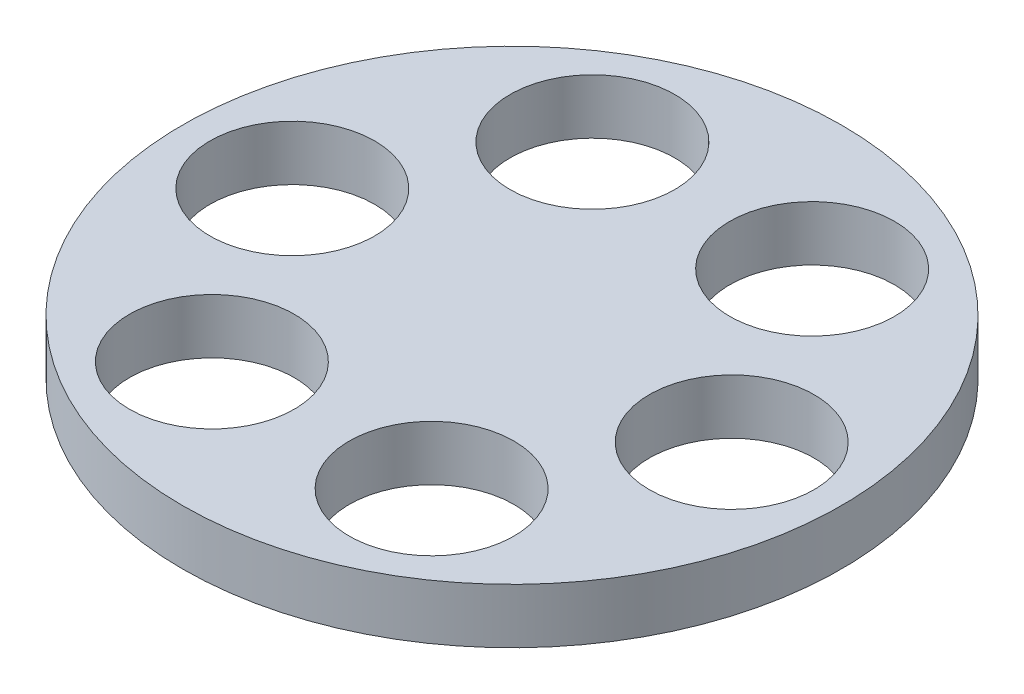
ISO-10303-21;
HEADER;
FILE_DESCRIPTION(('STEP AP214'),'2;1');
FILE_NAME('part.step','',(''),(''),'','','');
FILE_SCHEMA(('AUTOMOTIVE_DESIGN { 1 0 10303 214 1 1 1 1 }'));
ENDSEC;
DATA;
#1=APPLICATION_CONTEXT('core data for automotive mechanical design processes');
#2=APPLICATION_PROTOCOL_DEFINITION('international standard','automotive_design',2000,#1);
#3=PRODUCT_CONTEXT('',#1,'mechanical');
#4=PRODUCT('Part','Part','',(#3));
#5=PRODUCT_RELATED_PRODUCT_CATEGORY('part','',(#4));
#6=PRODUCT_DEFINITION_FORMATION('','',#4);
#7=PRODUCT_DEFINITION_CONTEXT('part definition',#1,'design');
#8=PRODUCT_DEFINITION('design','',#6,#7);
#9=PRODUCT_DEFINITION_SHAPE('','',#8);
#10=(LENGTH_UNIT() NAMED_UNIT(*) SI_UNIT(.MILLI.,.METRE.));
#11=(NAMED_UNIT(*) PLANE_ANGLE_UNIT() SI_UNIT($,.RADIAN.));
#12=(NAMED_UNIT(*) SI_UNIT($,.STERADIAN.) SOLID_ANGLE_UNIT());
#13=UNCERTAINTY_MEASURE_WITH_UNIT(LENGTH_MEASURE(1.E-05),#10,'distance_accuracy_value','');
#14=(GEOMETRIC_REPRESENTATION_CONTEXT(3) GLOBAL_UNCERTAINTY_ASSIGNED_CONTEXT((#13)) GLOBAL_UNIT_ASSIGNED_CONTEXT((#10,
#11,#12)) REPRESENTATION_CONTEXT('',''));
#15=CARTESIAN_POINT('',(0.,0.,0.));
#16=DIRECTION('',(0.,0.,1.));
#17=DIRECTION('',(1.,0.,0.));
#18=AXIS2_PLACEMENT_3D('',#15,#16,#17);
#19=CARTESIAN_POINT('',(0.,5.,0.));
#20=DIRECTION('',(0.,-1.,0.));
#21=DIRECTION('',(0.,0.,-1.));
#22=AXIS2_PLACEMENT_3D('',#19,#20,#21);
#23=CYLINDRICAL_SURFACE('',#22,60.);
#24=CARTESIAN_POINT('',(0.,5.,0.));
#25=DIRECTION('',(0.,1.,0.));
#26=DIRECTION('',(0.,0.,1.));
#27=AXIS2_PLACEMENT_3D('',#24,#25,#26);
#28=CIRCLE('',#27,60.);
#29=CARTESIAN_POINT('',(0.,5.,60.));
#30=VERTEX_POINT('',#29);
#31=EDGE_CURVE('E10',#30,#30,#28,.T.);
#32=ORIENTED_EDGE('',*,*,#31,.F.);
#33=EDGE_LOOP('',(#32));
#34=FACE_BOUND('',#33,.T.);
#35=CARTESIAN_POINT('',(0.,-5.,0.));
#36=DIRECTION('',(0.,1.,0.));
#37=DIRECTION('',(0.,0.,1.));
#38=AXIS2_PLACEMENT_3D('',#35,#36,#37);
#39=CIRCLE('',#38,60.);
#40=CARTESIAN_POINT('',(0.,-5.,60.));
#41=VERTEX_POINT('',#40);
#42=EDGE_CURVE('E34',#41,#41,#39,.T.);
#43=ORIENTED_EDGE('',*,*,#42,.T.);
#44=EDGE_LOOP('',(#43));
#45=FACE_BOUND('',#44,.T.);
#46=ADVANCED_FACE('F31',(#34,#45),#23,.T.);
#47=CARTESIAN_POINT('',(0.,5.,0.));
#48=DIRECTION('',(0.,1.,0.));
#49=DIRECTION('',(0.,0.,1.));
#50=AXIS2_PLACEMENT_3D('',#47,#48,#49);
#51=PLANE('',#50);
#52=CARTESIAN_POINT('',(20.0000000000004,5.,34.6410161513773));
#53=DIRECTION('',(0.,1.,0.));
#54=DIRECTION('',(-0.866025403784433,0.,0.50000000000001));
#55=AXIS2_PLACEMENT_3D('',#52,#53,#54);
#56=CIRCLE('',#55,15.);
#57=CARTESIAN_POINT('',(7.00961894323391,5.,42.1410161513775));
#58=VERTEX_POINT('',#57);
#59=EDGE_CURVE('E59',#58,#58,#56,.T.);
#60=ORIENTED_EDGE('',*,*,#59,.F.);
#61=EDGE_LOOP('',(#60));
#62=FACE_BOUND('',#61,.T.);
#63=CARTESIAN_POINT('',(-19.9999999999997,5.,34.6410161513777));
#64=DIRECTION('',(0.,1.,0.));
#65=DIRECTION('',(-0.866025403784443,0.,-0.499999999999992));
#66=AXIS2_PLACEMENT_3D('',#63,#64,#65);
#67=CIRCLE('',#66,15.);
#68=CARTESIAN_POINT('',(-32.9903810567663,5.,27.1410161513779));
#69=VERTEX_POINT('',#68);
#70=EDGE_CURVE('E58',#69,#69,#67,.T.);
#71=ORIENTED_EDGE('',*,*,#70,.F.);
#72=EDGE_LOOP('',(#71));
#73=FACE_BOUND('',#72,.T.);
#74=CARTESIAN_POINT('',(-40.,5.,0.));
#75=DIRECTION('',(0.,1.,0.));
#76=DIRECTION('',(0.,0.,-1.));
#77=AXIS2_PLACEMENT_3D('',#74,#75,#76);
#78=CIRCLE('',#77,15.);
#79=CARTESIAN_POINT('',(-40.,5.,-15.));
#80=VERTEX_POINT('',#79);
#81=EDGE_CURVE('E65',#80,#80,#78,.T.);
#82=ORIENTED_EDGE('',*,*,#81,.F.);
#83=EDGE_LOOP('',(#82));
#84=FACE_BOUND('',#83,.T.);
#85=CARTESIAN_POINT('',(-20.0000000000002,5.,-34.6410161513775));
#86=DIRECTION('',(0.,1.,0.));
#87=DIRECTION('',(0.866025403784436,0.,-0.500000000000004));
#88=AXIS2_PLACEMENT_3D('',#85,#86,#87);
#89=CIRCLE('',#88,15.);
#90=CARTESIAN_POINT('',(-7.00961894323362,5.,-42.1410161513775));
#91=VERTEX_POINT('',#90);
#92=EDGE_CURVE('E71',#91,#91,#89,.T.);
#93=ORIENTED_EDGE('',*,*,#92,.F.);
#94=EDGE_LOOP('',(#93));
#95=FACE_BOUND('',#94,.T.);
#96=CARTESIAN_POINT('',(19.9999999999999,5.,-34.6410161513776));
#97=DIRECTION('',(0.,1.,0.));
#98=DIRECTION('',(0.86602540378444,0.,0.499999999999998));
#99=AXIS2_PLACEMENT_3D('',#96,#97,#98);
#100=CIRCLE('',#99,15.);
#101=CARTESIAN_POINT('',(32.9903810567665,5.,-27.1410161513776));
#102=VERTEX_POINT('',#101);
#103=EDGE_CURVE('E51',#102,#102,#100,.T.);
#104=ORIENTED_EDGE('',*,*,#103,.F.);
#105=EDGE_LOOP('',(#104));
#106=FACE_BOUND('',#105,.T.);
#107=CARTESIAN_POINT('',(40.,5.,0.));
#108=DIRECTION('',(0.,1.,0.));
#109=DIRECTION('',(0.,0.,1.));
#110=AXIS2_PLACEMENT_3D('',#107,#108,#109);
#111=CIRCLE('',#110,15.);
#112=CARTESIAN_POINT('',(40.,5.,15.));
#113=VERTEX_POINT('',#112);
#114=EDGE_CURVE('E45',#113,#113,#111,.T.);
#115=ORIENTED_EDGE('',*,*,#114,.F.);
#116=EDGE_LOOP('',(#115));
#117=FACE_BOUND('',#116,.T.);
#118=ORIENTED_EDGE('',*,*,#31,.T.);
#119=EDGE_LOOP('',(#118));
#120=FACE_BOUND('',#119,.T.);
#121=ADVANCED_FACE('F81',(#62,#73,#84,#95,#106,#117,#120),#51,.T.);
#122=CARTESIAN_POINT('',(0.,-5.,0.));
#123=DIRECTION('',(0.,1.,0.));
#124=DIRECTION('',(0.,0.,1.));
#125=AXIS2_PLACEMENT_3D('',#122,#123,#124);
#126=PLANE('',#125);
#127=CARTESIAN_POINT('',(20.0000000000004,-5.,34.6410161513773));
#128=DIRECTION('',(0.,1.,0.));
#129=DIRECTION('',(-0.866025403784433,0.,0.50000000000001));
#130=AXIS2_PLACEMENT_3D('',#127,#128,#129);
#131=CIRCLE('',#130,15.);
#132=CARTESIAN_POINT('',(7.00961894323391,-5.,42.1410161513775));
#133=VERTEX_POINT('',#132);
#134=EDGE_CURVE('E55',#133,#133,#131,.T.);
#135=ORIENTED_EDGE('',*,*,#134,.T.);
#136=EDGE_LOOP('',(#135));
#137=FACE_BOUND('',#136,.T.);
#138=CARTESIAN_POINT('',(-19.9999999999997,-5.,34.6410161513777));
#139=DIRECTION('',(0.,1.,0.));
#140=DIRECTION('',(-0.866025403784443,0.,-0.499999999999992));
#141=AXIS2_PLACEMENT_3D('',#138,#139,#140);
#142=CIRCLE('',#141,15.);
#143=CARTESIAN_POINT('',(-32.9903810567663,-5.,27.1410161513779));
#144=VERTEX_POINT('',#143);
#145=EDGE_CURVE('E62',#144,#144,#142,.T.);
#146=ORIENTED_EDGE('',*,*,#145,.T.);
#147=EDGE_LOOP('',(#146));
#148=FACE_BOUND('',#147,.T.);
#149=CARTESIAN_POINT('',(-40.,-5.,0.));
#150=DIRECTION('',(0.,1.,0.));
#151=DIRECTION('',(0.,0.,-1.));
#152=AXIS2_PLACEMENT_3D('',#149,#150,#151);
#153=CIRCLE('',#152,15.);
#154=CARTESIAN_POINT('',(-40.,-5.,-15.));
#155=VERTEX_POINT('',#154);
#156=EDGE_CURVE('E68',#155,#155,#153,.T.);
#157=ORIENTED_EDGE('',*,*,#156,.T.);
#158=EDGE_LOOP('',(#157));
#159=FACE_BOUND('',#158,.T.);
#160=CARTESIAN_POINT('',(-20.0000000000002,-5.,-34.6410161513775));
#161=DIRECTION('',(0.,1.,0.));
#162=DIRECTION('',(0.866025403784436,0.,-0.500000000000004));
#163=AXIS2_PLACEMENT_3D('',#160,#161,#162);
#164=CIRCLE('',#163,15.);
#165=CARTESIAN_POINT('',(-7.00961894323362,-5.,-42.1410161513775));
#166=VERTEX_POINT('',#165);
#167=EDGE_CURVE('E54',#166,#166,#164,.T.);
#168=ORIENTED_EDGE('',*,*,#167,.T.);
#169=EDGE_LOOP('',(#168));
#170=FACE_BOUND('',#169,.T.);
#171=CARTESIAN_POINT('',(19.9999999999999,-5.,-34.6410161513776));
#172=DIRECTION('',(0.,1.,0.));
#173=DIRECTION('',(0.86602540378444,0.,0.499999999999998));
#174=AXIS2_PLACEMENT_3D('',#171,#172,#173);
#175=CIRCLE('',#174,15.);
#176=CARTESIAN_POINT('',(32.9903810567665,-5.,-27.1410161513776));
#177=VERTEX_POINT('',#176);
#178=EDGE_CURVE('E48',#177,#177,#175,.T.);
#179=ORIENTED_EDGE('',*,*,#178,.T.);
#180=EDGE_LOOP('',(#179));
#181=FACE_BOUND('',#180,.T.);
#182=CARTESIAN_POINT('',(40.,-5.,0.));
#183=DIRECTION('',(0.,1.,0.));
#184=DIRECTION('',(0.,0.,1.));
#185=AXIS2_PLACEMENT_3D('',#182,#183,#184);
#186=CIRCLE('',#185,15.);
#187=CARTESIAN_POINT('',(40.,-5.,15.));
#188=VERTEX_POINT('',#187);
#189=EDGE_CURVE('E41',#188,#188,#186,.T.);
#190=ORIENTED_EDGE('',*,*,#189,.T.);
#191=EDGE_LOOP('',(#190));
#192=FACE_BOUND('',#191,.T.);
#193=ORIENTED_EDGE('',*,*,#42,.F.);
#194=EDGE_LOOP('',(#193));
#195=FACE_BOUND('',#194,.T.);
#196=ADVANCED_FACE('F84',(#137,#148,#159,#170,#181,#192,#195),#126,.F.);
#197=CARTESIAN_POINT('',(40.,-5.,0.));
#198=DIRECTION('',(0.,1.,0.));
#199=DIRECTION('',(0.,0.,1.));
#200=AXIS2_PLACEMENT_3D('',#197,#198,#199);
#201=CYLINDRICAL_SURFACE('',#200,15.);
#202=ORIENTED_EDGE('',*,*,#189,.F.);
#203=EDGE_LOOP('',(#202));
#204=FACE_BOUND('',#203,.T.);
#205=ORIENTED_EDGE('',*,*,#114,.T.);
#206=EDGE_LOOP('',(#205));
#207=FACE_BOUND('',#206,.T.);
#208=ADVANCED_FACE('F91',(#204,#207),#201,.F.);
#209=CARTESIAN_POINT('',(19.9999999999999,-5.,-34.6410161513776));
#210=DIRECTION('',(0.,1.,0.));
#211=DIRECTION('',(0.,0.,1.));
#212=AXIS2_PLACEMENT_3D('',#209,#210,#211);
#213=CYLINDRICAL_SURFACE('',#212,15.);
#214=ORIENTED_EDGE('',*,*,#178,.F.);
#215=EDGE_LOOP('',(#214));
#216=FACE_BOUND('',#215,.T.);
#217=ORIENTED_EDGE('',*,*,#103,.T.);
#218=EDGE_LOOP('',(#217));
#219=FACE_BOUND('',#218,.T.);
#220=ADVANCED_FACE('F93',(#216,#219),#213,.F.);
#221=CARTESIAN_POINT('',(-20.0000000000002,-5.,-34.6410161513775));
#222=DIRECTION('',(0.,1.,0.));
#223=DIRECTION('',(0.,0.,1.));
#224=AXIS2_PLACEMENT_3D('',#221,#222,#223);
#225=CYLINDRICAL_SURFACE('',#224,15.);
#226=ORIENTED_EDGE('',*,*,#167,.F.);
#227=EDGE_LOOP('',(#226));
#228=FACE_BOUND('',#227,.T.);
#229=ORIENTED_EDGE('',*,*,#92,.T.);
#230=EDGE_LOOP('',(#229));
#231=FACE_BOUND('',#230,.T.);
#232=ADVANCED_FACE('F79',(#228,#231),#225,.F.);
#233=CARTESIAN_POINT('',(-40.,-5.,0.));
#234=DIRECTION('',(0.,1.,0.));
#235=DIRECTION('',(0.,0.,1.));
#236=AXIS2_PLACEMENT_3D('',#233,#234,#235);
#237=CYLINDRICAL_SURFACE('',#236,15.);
#238=ORIENTED_EDGE('',*,*,#156,.F.);
#239=EDGE_LOOP('',(#238));
#240=FACE_BOUND('',#239,.T.);
#241=ORIENTED_EDGE('',*,*,#81,.T.);
#242=EDGE_LOOP('',(#241));
#243=FACE_BOUND('',#242,.T.);
#244=ADVANCED_FACE('F135',(#240,#243),#237,.F.);
#245=CARTESIAN_POINT('',(-19.9999999999997,-5.,34.6410161513777));
#246=DIRECTION('',(0.,1.,0.));
#247=DIRECTION('',(0.,0.,1.));
#248=AXIS2_PLACEMENT_3D('',#245,#246,#247);
#249=CYLINDRICAL_SURFACE('',#248,15.);
#250=ORIENTED_EDGE('',*,*,#145,.F.);
#251=EDGE_LOOP('',(#250));
#252=FACE_BOUND('',#251,.T.);
#253=ORIENTED_EDGE('',*,*,#70,.T.);
#254=EDGE_LOOP('',(#253));
#255=FACE_BOUND('',#254,.T.);
#256=ADVANCED_FACE('F145',(#252,#255),#249,.F.);
#257=CARTESIAN_POINT('',(20.0000000000004,-5.,34.6410161513773));
#258=DIRECTION('',(0.,1.,0.));
#259=DIRECTION('',(0.,0.,1.));
#260=AXIS2_PLACEMENT_3D('',#257,#258,#259);
#261=CYLINDRICAL_SURFACE('',#260,15.);
#262=ORIENTED_EDGE('',*,*,#134,.F.);
#263=EDGE_LOOP('',(#262));
#264=FACE_BOUND('',#263,.T.);
#265=ORIENTED_EDGE('',*,*,#59,.T.);
#266=EDGE_LOOP('',(#265));
#267=FACE_BOUND('',#266,.T.);
#268=ADVANCED_FACE('F155',(#264,#267),#261,.F.);
#269=CLOSED_SHELL('',(#46,#121,#196,#208,#220,#232,#244,#256,#268));
#270=MANIFOLD_SOLID_BREP('B2',#269);
#271=ADVANCED_BREP_SHAPE_REPRESENTATION('',(#18,#270),#14);
#272=SHAPE_DEFINITION_REPRESENTATION(#9,#271);
ENDSEC;
END-ISO-10303-21;
